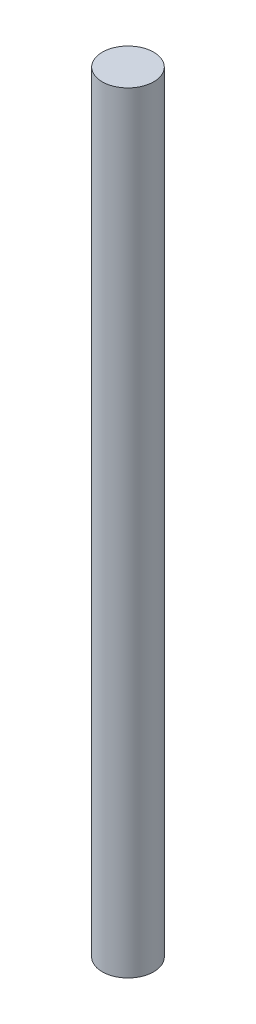
ISO-10303-21;
HEADER;
FILE_DESCRIPTION(('STEP AP214'),'2;1');
FILE_NAME('part.step','',(''),(''),'','','');
FILE_SCHEMA(('AUTOMOTIVE_DESIGN { 1 0 10303 214 1 1 1 1 }'));
ENDSEC;
DATA;
#1=APPLICATION_CONTEXT('core data for automotive mechanical design processes');
#2=APPLICATION_PROTOCOL_DEFINITION('international standard','automotive_design',2000,#1);
#3=PRODUCT_CONTEXT('',#1,'mechanical');
#4=PRODUCT('Part','Part','',(#3));
#5=PRODUCT_RELATED_PRODUCT_CATEGORY('part','',(#4));
#6=PRODUCT_DEFINITION_FORMATION('','',#4);
#7=PRODUCT_DEFINITION_CONTEXT('part definition',#1,'design');
#8=PRODUCT_DEFINITION('design','',#6,#7);
#9=PRODUCT_DEFINITION_SHAPE('','',#8);
#10=(LENGTH_UNIT() NAMED_UNIT(*) SI_UNIT(.MILLI.,.METRE.));
#11=(NAMED_UNIT(*) PLANE_ANGLE_UNIT() SI_UNIT($,.RADIAN.));
#12=(NAMED_UNIT(*) SI_UNIT($,.STERADIAN.) SOLID_ANGLE_UNIT());
#13=UNCERTAINTY_MEASURE_WITH_UNIT(LENGTH_MEASURE(1.E-05),#10,'distance_accuracy_value','');
#14=(GEOMETRIC_REPRESENTATION_CONTEXT(3) GLOBAL_UNCERTAINTY_ASSIGNED_CONTEXT((#13)) GLOBAL_UNIT_ASSIGNED_CONTEXT((#10,
#11,#12)) REPRESENTATION_CONTEXT('',''));
#15=CARTESIAN_POINT('',(0.,0.,0.));
#16=DIRECTION('',(0.,0.,1.));
#17=DIRECTION('',(1.,0.,0.));
#18=AXIS2_PLACEMENT_3D('',#15,#16,#17);
#19=CARTESIAN_POINT('',(0.,150.,0.));
#20=DIRECTION('',(0.,-1.,0.));
#21=DIRECTION('',(0.,0.,-1.));
#22=AXIS2_PLACEMENT_3D('',#19,#20,#21);
#23=CYLINDRICAL_SURFACE('',#22,5.);
#24=CARTESIAN_POINT('',(0.,150.,0.));
#25=DIRECTION('',(0.,1.,0.));
#26=DIRECTION('',(0.,0.,1.));
#27=AXIS2_PLACEMENT_3D('',#24,#25,#26);
#28=CIRCLE('',#27,5.);
#29=CARTESIAN_POINT('',(0.,150.,5.));
#30=VERTEX_POINT('',#29);
#31=EDGE_CURVE('E10',#30,#30,#28,.T.);
#32=ORIENTED_EDGE('',*,*,#31,.F.);
#33=EDGE_LOOP('',(#32));
#34=FACE_BOUND('',#33,.T.);
#35=CARTESIAN_POINT('',(0.,0.,0.));
#36=DIRECTION('',(0.,1.,0.));
#37=DIRECTION('',(0.,0.,1.));
#38=AXIS2_PLACEMENT_3D('',#35,#36,#37);
#39=CIRCLE('',#38,5.);
#40=CARTESIAN_POINT('',(0.,0.,5.));
#41=VERTEX_POINT('',#40);
#42=EDGE_CURVE('E37',#41,#41,#39,.T.);
#43=ORIENTED_EDGE('',*,*,#42,.T.);
#44=EDGE_LOOP('',(#43));
#45=FACE_BOUND('',#44,.T.);
#46=ADVANCED_FACE('F34',(#34,#45),#23,.T.);
#47=CARTESIAN_POINT('',(0.,150.,0.));
#48=DIRECTION('',(0.,1.,0.));
#49=DIRECTION('',(0.,0.,1.));
#50=AXIS2_PLACEMENT_3D('',#47,#48,#49);
#51=PLANE('',#50);
#52=ORIENTED_EDGE('',*,*,#31,.T.);
#53=EDGE_LOOP('',(#52));
#54=FACE_BOUND('',#53,.T.);
#55=ADVANCED_FACE('F49',(#54),#51,.T.);
#56=CARTESIAN_POINT('',(0.,0.,0.));
#57=DIRECTION('',(0.,1.,0.));
#58=DIRECTION('',(0.,0.,1.));
#59=AXIS2_PLACEMENT_3D('',#56,#57,#58);
#60=PLANE('',#59);
#61=ORIENTED_EDGE('',*,*,#42,.F.);
#62=EDGE_LOOP('',(#61));
#63=FACE_BOUND('',#62,.T.);
#64=ADVANCED_FACE('F47',(#63),#60,.F.);
#65=CLOSED_SHELL('',(#46,#55,#64));
#66=MANIFOLD_SOLID_BREP('B2',#65);
#67=ADVANCED_BREP_SHAPE_REPRESENTATION('',(#18,#66),#14);
#68=SHAPE_DEFINITION_REPRESENTATION(#9,#67);
ENDSEC;
END-ISO-10303-21;
